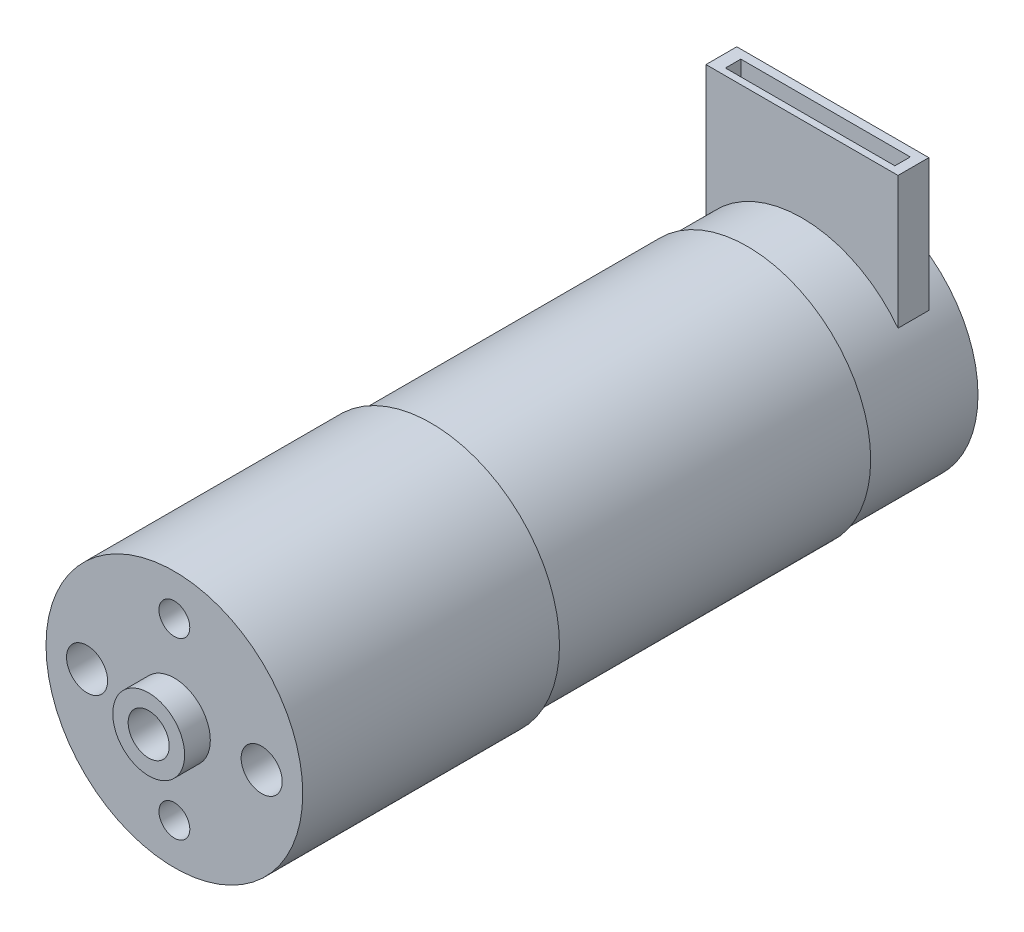
ISO-10303-21;
HEADER;
FILE_DESCRIPTION(('STEP AP214'),'2;1');
FILE_NAME('part.step','',(''),(''),'','','');
FILE_SCHEMA(('AUTOMOTIVE_DESIGN { 1 0 10303 214 1 1 1 1 }'));
ENDSEC;
DATA;
#1=APPLICATION_CONTEXT('core data for automotive mechanical design processes');
#2=APPLICATION_PROTOCOL_DEFINITION('international standard','automotive_design',2000,#1);
#3=PRODUCT_CONTEXT('',#1,'mechanical');
#4=PRODUCT('Part','Part','',(#3));
#5=PRODUCT_RELATED_PRODUCT_CATEGORY('part','',(#4));
#6=PRODUCT_DEFINITION_FORMATION('','',#4);
#7=PRODUCT_DEFINITION_CONTEXT('part definition',#1,'design');
#8=PRODUCT_DEFINITION('design','',#6,#7);
#9=PRODUCT_DEFINITION_SHAPE('','',#8);
#10=(LENGTH_UNIT() NAMED_UNIT(*) SI_UNIT(.MILLI.,.METRE.));
#11=(NAMED_UNIT(*) PLANE_ANGLE_UNIT() SI_UNIT($,.RADIAN.));
#12=(NAMED_UNIT(*) SI_UNIT($,.STERADIAN.) SOLID_ANGLE_UNIT());
#13=UNCERTAINTY_MEASURE_WITH_UNIT(LENGTH_MEASURE(1.E-05),#10,'distance_accuracy_value','');
#14=(GEOMETRIC_REPRESENTATION_CONTEXT(3) GLOBAL_UNCERTAINTY_ASSIGNED_CONTEXT((#13)) GLOBAL_UNIT_ASSIGNED_CONTEXT((#10,
#11,#12)) REPRESENTATION_CONTEXT('',''));
#15=CARTESIAN_POINT('',(0.,0.,0.));
#16=DIRECTION('',(0.,0.,1.));
#17=DIRECTION('',(1.,0.,0.));
#18=AXIS2_PLACEMENT_3D('',#15,#16,#17);
#19=CARTESIAN_POINT('',(0.,0.,-10.7));
#20=DIRECTION('',(0.,0.,1.));
#21=DIRECTION('',(1.,0.,0.));
#22=AXIS2_PLACEMENT_3D('',#19,#20,#21);
#23=CYLINDRICAL_SURFACE('',#22,11.75);
#24=CARTESIAN_POINT('',(0.,0.,0.));
#25=DIRECTION('',(0.,0.,1.));
#26=DIRECTION('',(1.,0.,0.));
#27=AXIS2_PLACEMENT_3D('',#24,#25,#26);
#28=CIRCLE('',#27,11.75);
#29=CARTESIAN_POINT('',(11.75,0.,0.));
#30=VERTEX_POINT('',#29);
#31=EDGE_CURVE('E181',#30,#30,#28,.F.);
#32=ORIENTED_EDGE('',*,*,#31,.T.);
#33=EDGE_LOOP('',(#32));
#34=FACE_BOUND('',#33,.T.);
#35=CARTESIAN_POINT('',(0.,0.,-10.7));
#36=DIRECTION('',(0.,0.,-1.));
#37=DIRECTION('',(-1.,0.,0.));
#38=AXIS2_PLACEMENT_3D('',#35,#36,#37);
#39=CIRCLE('',#38,11.75);
#40=CARTESIAN_POINT('',(-11.75,0.,-10.7));
#41=VERTEX_POINT('',#40);
#42=EDGE_CURVE('E162',#41,#41,#39,.T.);
#43=ORIENTED_EDGE('',*,*,#42,.F.);
#44=EDGE_LOOP('',(#43));
#45=FACE_BOUND('',#44,.T.);
#46=DIRECTION('',(0.,0.,1.));
#47=VECTOR('',#46,1.);
#48=CARTESIAN_POINT('',(-9.34971648878689,7.11655124195045,-10.7));
#49=LINE('',#48,#47);
#50=CARTESIAN_POINT('',(-9.34971648878689,7.11655124195045,-8.31237413965429));
#51=VERTEX_POINT('',#50);
#52=CARTESIAN_POINT('',(-9.34971648878689,7.11655124195045,-5.31237413965429));
#53=VERTEX_POINT('',#52);
#54=EDGE_CURVE('E11',#51,#53,#49,.T.);
#55=ORIENTED_EDGE('',*,*,#54,.F.);
#56=CARTESIAN_POINT('',(0.,0.,-8.31237413965429));
#57=DIRECTION('',(0.,0.,1.));
#58=DIRECTION('',(1.,0.,0.));
#59=AXIS2_PLACEMENT_3D('',#56,#57,#58);
#60=CIRCLE('',#59,11.75);
#61=CARTESIAN_POINT('',(9.34971648878689,7.11655124195045,-8.31237413965429));
#62=VERTEX_POINT('',#61);
#63=EDGE_CURVE('E186',#62,#51,#60,.T.);
#64=ORIENTED_EDGE('',*,*,#63,.F.);
#65=DIRECTION('',(0.,0.,1.));
#66=VECTOR('',#65,1.);
#67=CARTESIAN_POINT('',(9.34971648878689,7.11655124195045,-10.7));
#68=LINE('',#67,#66);
#69=CARTESIAN_POINT('',(9.34971648878689,7.11655124195045,-5.31237413965429));
#70=VERTEX_POINT('',#69);
#71=EDGE_CURVE('E189',#70,#62,#68,.F.);
#72=ORIENTED_EDGE('',*,*,#71,.F.);
#73=CARTESIAN_POINT('',(0.,0.,-5.31237413965429));
#74=DIRECTION('',(0.,0.,-1.));
#75=DIRECTION('',(-1.,0.,0.));
#76=AXIS2_PLACEMENT_3D('',#73,#74,#75);
#77=CIRCLE('',#76,11.75);
#78=EDGE_CURVE('E44',#53,#70,#77,.T.);
#79=ORIENTED_EDGE('',*,*,#78,.F.);
#80=EDGE_LOOP('',(#55,#64,#72,#79));
#81=FACE_BOUND('',#80,.T.);
#82=ADVANCED_FACE('F36',(#34,#45,#81),#23,.T.);
#83=CARTESIAN_POINT('',(0.,0.,30.8));
#84=DIRECTION('',(0.,0.,-1.));
#85=DIRECTION('',(-1.,0.,0.));
#86=AXIS2_PLACEMENT_3D('',#83,#84,#85);
#87=CYLINDRICAL_SURFACE('',#86,12.);
#88=CARTESIAN_POINT('',(0.,0.,30.8));
#89=DIRECTION('',(0.,0.,1.));
#90=DIRECTION('',(1.,0.,0.));
#91=AXIS2_PLACEMENT_3D('',#88,#89,#90);
#92=CIRCLE('',#91,12.);
#93=CARTESIAN_POINT('',(12.,0.,30.8));
#94=VERTEX_POINT('',#93);
#95=EDGE_CURVE('E178',#94,#94,#92,.T.);
#96=ORIENTED_EDGE('',*,*,#95,.F.);
#97=EDGE_LOOP('',(#96));
#98=FACE_BOUND('',#97,.T.);
#99=CARTESIAN_POINT('',(0.,0.,0.));
#100=DIRECTION('',(0.,0.,1.));
#101=DIRECTION('',(1.,0.,0.));
#102=AXIS2_PLACEMENT_3D('',#99,#100,#101);
#103=CIRCLE('',#102,12.);
#104=CARTESIAN_POINT('',(12.,0.,0.));
#105=VERTEX_POINT('',#104);
#106=EDGE_CURVE('E175',#105,#105,#103,.T.);
#107=ORIENTED_EDGE('',*,*,#106,.T.);
#108=EDGE_LOOP('',(#107));
#109=FACE_BOUND('',#108,.T.);
#110=ADVANCED_FACE('F38',(#98,#109),#87,.T.);
#111=CARTESIAN_POINT('',(0.,0.,0.));
#112=DIRECTION('',(0.,0.,1.));
#113=DIRECTION('',(1.,0.,0.));
#114=AXIS2_PLACEMENT_3D('',#111,#112,#113);
#115=PLANE('',#114);
#116=ORIENTED_EDGE('',*,*,#31,.F.);
#117=EDGE_LOOP('',(#116));
#118=FACE_BOUND('',#117,.T.);
#119=ORIENTED_EDGE('',*,*,#106,.F.);
#120=EDGE_LOOP('',(#119));
#121=FACE_BOUND('',#120,.T.);
#122=ADVANCED_FACE('F224',(#118,#121),#115,.F.);
#123=CARTESIAN_POINT('',(0.,0.,55.8));
#124=DIRECTION('',(0.,0.,-1.));
#125=DIRECTION('',(-1.,0.,0.));
#126=AXIS2_PLACEMENT_3D('',#123,#124,#125);
#127=CYLINDRICAL_SURFACE('',#126,12.5);
#128=CARTESIAN_POINT('',(0.,0.,55.8));
#129=DIRECTION('',(0.,0.,1.));
#130=DIRECTION('',(1.,0.,0.));
#131=AXIS2_PLACEMENT_3D('',#128,#129,#130);
#132=CIRCLE('',#131,12.5);
#133=CARTESIAN_POINT('',(12.5,0.,55.8));
#134=VERTEX_POINT('',#133);
#135=EDGE_CURVE('E172',#134,#134,#132,.T.);
#136=ORIENTED_EDGE('',*,*,#135,.F.);
#137=EDGE_LOOP('',(#136));
#138=FACE_BOUND('',#137,.T.);
#139=CARTESIAN_POINT('',(0.,0.,30.8));
#140=DIRECTION('',(0.,0.,1.));
#141=DIRECTION('',(1.,0.,0.));
#142=AXIS2_PLACEMENT_3D('',#139,#140,#141);
#143=CIRCLE('',#142,12.5);
#144=CARTESIAN_POINT('',(12.5,0.,30.8));
#145=VERTEX_POINT('',#144);
#146=EDGE_CURVE('E169',#145,#145,#143,.T.);
#147=ORIENTED_EDGE('',*,*,#146,.T.);
#148=EDGE_LOOP('',(#147));
#149=FACE_BOUND('',#148,.T.);
#150=ADVANCED_FACE('F243',(#138,#149),#127,.T.);
#151=CARTESIAN_POINT('',(0.,0.,55.8));
#152=DIRECTION('',(0.,0.,1.));
#153=DIRECTION('',(1.,0.,0.));
#154=AXIS2_PLACEMENT_3D('',#151,#152,#153);
#155=PLANE('',#154);
#156=CARTESIAN_POINT('',(0.,8.5,55.8));
#157=DIRECTION('',(0.,0.,1.));
#158=DIRECTION('',(1.,0.,0.));
#159=AXIS2_PLACEMENT_3D('',#156,#157,#158);
#160=CIRCLE('',#159,1.5);
#161=CARTESIAN_POINT('',(1.5,8.5,55.8));
#162=VERTEX_POINT('',#161);
#163=EDGE_CURVE('E461',#162,#162,#160,.T.);
#164=ORIENTED_EDGE('',*,*,#163,.F.);
#165=EDGE_LOOP('',(#164));
#166=FACE_BOUND('',#165,.T.);
#167=CARTESIAN_POINT('',(8.5,0.,55.8));
#168=DIRECTION('',(0.,0.,1.));
#169=DIRECTION('',(1.,0.,0.));
#170=AXIS2_PLACEMENT_3D('',#167,#168,#169);
#171=CIRCLE('',#170,2.);
#172=CARTESIAN_POINT('',(10.5,0.,55.8));
#173=VERTEX_POINT('',#172);
#174=EDGE_CURVE('E470',#173,#173,#171,.T.);
#175=ORIENTED_EDGE('',*,*,#174,.F.);
#176=EDGE_LOOP('',(#175));
#177=FACE_BOUND('',#176,.T.);
#178=CARTESIAN_POINT('',(-8.5,0.,55.8));
#179=DIRECTION('',(0.,0.,1.));
#180=DIRECTION('',(-1.,0.,0.));
#181=AXIS2_PLACEMENT_3D('',#178,#179,#180);
#182=CIRCLE('',#181,2.);
#183=CARTESIAN_POINT('',(-10.5,0.,55.8));
#184=VERTEX_POINT('',#183);
#185=EDGE_CURVE('E476',#184,#184,#182,.T.);
#186=ORIENTED_EDGE('',*,*,#185,.F.);
#187=EDGE_LOOP('',(#186));
#188=FACE_BOUND('',#187,.T.);
#189=CARTESIAN_POINT('',(0.,-8.5,55.8));
#190=DIRECTION('',(0.,0.,1.));
#191=DIRECTION('',(-1.,0.,0.));
#192=AXIS2_PLACEMENT_3D('',#189,#190,#191);
#193=CIRCLE('',#192,1.5);
#194=CARTESIAN_POINT('',(-1.5,-8.5,55.8));
#195=VERTEX_POINT('',#194);
#196=EDGE_CURVE('E482',#195,#195,#193,.T.);
#197=ORIENTED_EDGE('',*,*,#196,.F.);
#198=EDGE_LOOP('',(#197));
#199=FACE_BOUND('',#198,.T.);
#200=CARTESIAN_POINT('',(0.,0.,55.8));
#201=DIRECTION('',(0.,0.,1.));
#202=DIRECTION('',(1.,0.,0.));
#203=AXIS2_PLACEMENT_3D('',#200,#201,#202);
#204=CIRCLE('',#203,3.5);
#205=CARTESIAN_POINT('',(3.5,0.,55.8));
#206=VERTEX_POINT('',#205);
#207=EDGE_CURVE('E165',#206,#206,#204,.T.);
#208=ORIENTED_EDGE('',*,*,#207,.F.);
#209=EDGE_LOOP('',(#208));
#210=FACE_BOUND('',#209,.T.);
#211=ORIENTED_EDGE('',*,*,#135,.T.);
#212=EDGE_LOOP('',(#211));
#213=FACE_BOUND('',#212,.T.);
#214=ADVANCED_FACE('F240',(#166,#177,#188,#199,#210,#213),#155,.T.);
#215=CARTESIAN_POINT('',(0.,0.,30.8));
#216=DIRECTION('',(0.,0.,1.));
#217=DIRECTION('',(1.,0.,0.));
#218=AXIS2_PLACEMENT_3D('',#215,#216,#217);
#219=PLANE('',#218);
#220=ORIENTED_EDGE('',*,*,#95,.T.);
#221=EDGE_LOOP('',(#220));
#222=FACE_BOUND('',#221,.T.);
#223=ORIENTED_EDGE('',*,*,#146,.F.);
#224=EDGE_LOOP('',(#223));
#225=FACE_BOUND('',#224,.T.);
#226=ADVANCED_FACE('F238',(#222,#225),#219,.F.);
#227=CARTESIAN_POINT('',(0.,0.,58.3));
#228=DIRECTION('',(0.,0.,-1.));
#229=DIRECTION('',(-1.,0.,0.));
#230=AXIS2_PLACEMENT_3D('',#227,#228,#229);
#231=CYLINDRICAL_SURFACE('',#230,3.5);
#232=CARTESIAN_POINT('',(0.,0.,58.3));
#233=DIRECTION('',(0.,0.,1.));
#234=DIRECTION('',(1.,0.,0.));
#235=AXIS2_PLACEMENT_3D('',#232,#233,#234);
#236=CIRCLE('',#235,3.5);
#237=CARTESIAN_POINT('',(3.5,0.,58.3));
#238=VERTEX_POINT('',#237);
#239=EDGE_CURVE('E166',#238,#238,#236,.T.);
#240=ORIENTED_EDGE('',*,*,#239,.F.);
#241=EDGE_LOOP('',(#240));
#242=FACE_BOUND('',#241,.T.);
#243=ORIENTED_EDGE('',*,*,#207,.T.);
#244=EDGE_LOOP('',(#243));
#245=FACE_BOUND('',#244,.T.);
#246=ADVANCED_FACE('F234',(#242,#245),#231,.T.);
#247=CARTESIAN_POINT('',(0.,0.,58.3));
#248=DIRECTION('',(0.,0.,1.));
#249=DIRECTION('',(1.,0.,0.));
#250=AXIS2_PLACEMENT_3D('',#247,#248,#249);
#251=PLANE('',#250);
#252=CARTESIAN_POINT('',(0.,0.,58.3));
#253=DIRECTION('',(0.,0.,1.));
#254=DIRECTION('',(1.,0.,0.));
#255=AXIS2_PLACEMENT_3D('',#252,#253,#254);
#256=CIRCLE('',#255,2.);
#257=CARTESIAN_POINT('',(2.,0.,58.3));
#258=VERTEX_POINT('',#257);
#259=EDGE_CURVE('E125',#258,#258,#256,.T.);
#260=ORIENTED_EDGE('',*,*,#259,.F.);
#261=EDGE_LOOP('',(#260));
#262=FACE_BOUND('',#261,.T.);
#263=ORIENTED_EDGE('',*,*,#239,.T.);
#264=EDGE_LOOP('',(#263));
#265=FACE_BOUND('',#264,.T.);
#266=ADVANCED_FACE('F231',(#262,#265),#251,.T.);
#267=CARTESIAN_POINT('',(0.,0.,-10.7));
#268=DIRECTION('',(0.,0.,-1.));
#269=DIRECTION('',(-1.,0.,0.));
#270=AXIS2_PLACEMENT_3D('',#267,#268,#269);
#271=PLANE('',#270);
#272=ORIENTED_EDGE('',*,*,#42,.T.);
#273=EDGE_LOOP('',(#272));
#274=FACE_BOUND('',#273,.T.);
#275=ADVANCED_FACE('F229',(#274),#271,.T.);
#276=CARTESIAN_POINT('',(-9.34971648878689,20.,-8.31237413965429));
#277=DIRECTION('',(1.,0.,0.));
#278=DIRECTION('',(0.,0.,-1.));
#279=AXIS2_PLACEMENT_3D('',#276,#277,#278);
#280=PLANE('',#279);
#281=DIRECTION('',(0.,-1.,0.));
#282=VECTOR('',#281,1.);
#283=CARTESIAN_POINT('',(-9.34971648878689,20.,-8.31237413965429));
#284=LINE('',#283,#282);
#285=CARTESIAN_POINT('',(-9.34971648878689,20.,-8.31237413965429));
#286=VERTEX_POINT('',#285);
#287=EDGE_CURVE('E150',#286,#51,#284,.T.);
#288=ORIENTED_EDGE('',*,*,#287,.T.);
#289=ORIENTED_EDGE('',*,*,#54,.T.);
#290=DIRECTION('',(0.,-1.,0.));
#291=VECTOR('',#290,1.);
#292=CARTESIAN_POINT('',(-9.34971648878689,20.,-5.31237413965429));
#293=LINE('',#292,#291);
#294=CARTESIAN_POINT('',(-9.34971648878689,20.,-5.31237413965429));
#295=VERTEX_POINT('',#294);
#296=EDGE_CURVE('E159',#295,#53,#293,.T.);
#297=ORIENTED_EDGE('',*,*,#296,.F.);
#298=DIRECTION('',(0.,0.,1.));
#299=VECTOR('',#298,1.);
#300=CARTESIAN_POINT('',(-9.34971648878689,20.,-8.31237413965429));
#301=LINE('',#300,#299);
#302=EDGE_CURVE('E138',#286,#295,#301,.T.);
#303=ORIENTED_EDGE('',*,*,#302,.F.);
#304=EDGE_LOOP('',(#288,#289,#297,#303));
#305=FACE_BOUND('',#304,.T.);
#306=ADVANCED_FACE('F205',(#305),#280,.F.);
#307=CARTESIAN_POINT('',(9.34971648878689,20.,-8.31237413965429));
#308=DIRECTION('',(-1.,0.,0.));
#309=DIRECTION('',(0.,0.,1.));
#310=AXIS2_PLACEMENT_3D('',#307,#308,#309);
#311=PLANE('',#310);
#312=DIRECTION('',(0.,-1.,0.));
#313=VECTOR('',#312,1.);
#314=CARTESIAN_POINT('',(9.34971648878689,20.,-5.31237413965429));
#315=LINE('',#314,#313);
#316=CARTESIAN_POINT('',(9.34971648878689,20.,-5.31237413965429));
#317=VERTEX_POINT('',#316);
#318=EDGE_CURVE('E156',#317,#70,#315,.T.);
#319=ORIENTED_EDGE('',*,*,#318,.T.);
#320=ORIENTED_EDGE('',*,*,#71,.T.);
#321=DIRECTION('',(0.,-1.,0.));
#322=VECTOR('',#321,1.);
#323=CARTESIAN_POINT('',(9.34971648878689,20.,-8.31237413965429));
#324=LINE('',#323,#322);
#325=CARTESIAN_POINT('',(9.34971648878689,20.,-8.31237413965429));
#326=VERTEX_POINT('',#325);
#327=EDGE_CURVE('E153',#326,#62,#324,.T.);
#328=ORIENTED_EDGE('',*,*,#327,.F.);
#329=DIRECTION('',(0.,0.,-1.));
#330=VECTOR('',#329,1.);
#331=CARTESIAN_POINT('',(9.34971648878689,20.,-8.31237413965429));
#332=LINE('',#331,#330);
#333=EDGE_CURVE('E146',#317,#326,#332,.T.);
#334=ORIENTED_EDGE('',*,*,#333,.F.);
#335=EDGE_LOOP('',(#319,#320,#328,#334));
#336=FACE_BOUND('',#335,.T.);
#337=ADVANCED_FACE('F197',(#336),#311,.F.);
#338=CARTESIAN_POINT('',(9.34971648878689,20.,-5.31237413965429));
#339=DIRECTION('',(0.,0.,-1.));
#340=DIRECTION('',(-1.,0.,0.));
#341=AXIS2_PLACEMENT_3D('',#338,#339,#340);
#342=PLANE('',#341);
#343=ORIENTED_EDGE('',*,*,#296,.T.);
#344=ORIENTED_EDGE('',*,*,#78,.T.);
#345=ORIENTED_EDGE('',*,*,#318,.F.);
#346=DIRECTION('',(1.,0.,0.));
#347=VECTOR('',#346,1.);
#348=CARTESIAN_POINT('',(9.34971648878689,20.,-5.31237413965429));
#349=LINE('',#348,#347);
#350=EDGE_CURVE('E144',#295,#317,#349,.T.);
#351=ORIENTED_EDGE('',*,*,#350,.F.);
#352=EDGE_LOOP('',(#343,#344,#345,#351));
#353=FACE_BOUND('',#352,.T.);
#354=ADVANCED_FACE('F193',(#353),#342,.F.);
#355=CARTESIAN_POINT('',(9.34971648878689,20.,-8.31237413965429));
#356=DIRECTION('',(0.,0.,1.));
#357=DIRECTION('',(1.,0.,0.));
#358=AXIS2_PLACEMENT_3D('',#355,#356,#357);
#359=PLANE('',#358);
#360=ORIENTED_EDGE('',*,*,#327,.T.);
#361=ORIENTED_EDGE('',*,*,#63,.T.);
#362=ORIENTED_EDGE('',*,*,#287,.F.);
#363=DIRECTION('',(-1.,0.,0.));
#364=VECTOR('',#363,1.);
#365=CARTESIAN_POINT('',(9.34971648878689,20.,-8.31237413965429));
#366=LINE('',#365,#364);
#367=EDGE_CURVE('E148',#326,#286,#366,.T.);
#368=ORIENTED_EDGE('',*,*,#367,.F.);
#369=EDGE_LOOP('',(#360,#361,#362,#368));
#370=FACE_BOUND('',#369,.T.);
#371=ADVANCED_FACE('F207',(#370),#359,.F.);
#372=CARTESIAN_POINT('',(0.,20.,0.));
#373=DIRECTION('',(0.,-1.,0.));
#374=DIRECTION('',(0.,0.,-1.));
#375=AXIS2_PLACEMENT_3D('',#372,#373,#374);
#376=PLANE('',#375);
#377=DIRECTION('',(1.,0.,0.));
#378=VECTOR('',#377,1.);
#379=CARTESIAN_POINT('',(8.38729640794611,20.,-5.96838946504422));
#380=LINE('',#379,#378);
#381=CARTESIAN_POINT('',(-8.11270359205389,20.,-5.96838946504422));
#382=VERTEX_POINT('',#381);
#383=CARTESIAN_POINT('',(8.38729640794611,20.,-5.96838946504422));
#384=VERTEX_POINT('',#383);
#385=EDGE_CURVE('E131',#382,#384,#380,.T.);
#386=ORIENTED_EDGE('',*,*,#385,.F.);
#387=DIRECTION('',(0.,0.,1.));
#388=VECTOR('',#387,1.);
#389=CARTESIAN_POINT('',(-8.11270359205389,20.,-7.46838946504422));
#390=LINE('',#389,#388);
#391=CARTESIAN_POINT('',(-8.11270359205389,20.,-7.46838946504422));
#392=VERTEX_POINT('',#391);
#393=EDGE_CURVE('E51',#392,#382,#390,.T.);
#394=ORIENTED_EDGE('',*,*,#393,.F.);
#395=DIRECTION('',(-1.,0.,0.));
#396=VECTOR('',#395,1.);
#397=CARTESIAN_POINT('',(8.38729640794611,20.,-7.46838946504422));
#398=LINE('',#397,#396);
#399=CARTESIAN_POINT('',(8.38729640794611,20.,-7.46838946504422));
#400=VERTEX_POINT('',#399);
#401=EDGE_CURVE('E119',#400,#392,#398,.T.);
#402=ORIENTED_EDGE('',*,*,#401,.F.);
#403=DIRECTION('',(0.,0.,-1.));
#404=VECTOR('',#403,1.);
#405=CARTESIAN_POINT('',(8.38729640794611,20.,-7.46838946504422));
#406=LINE('',#405,#404);
#407=EDGE_CURVE('E122',#384,#400,#406,.T.);
#408=ORIENTED_EDGE('',*,*,#407,.F.);
#409=EDGE_LOOP('',(#386,#394,#402,#408));
#410=FACE_BOUND('',#409,.T.);
#411=ORIENTED_EDGE('',*,*,#302,.T.);
#412=ORIENTED_EDGE('',*,*,#350,.T.);
#413=ORIENTED_EDGE('',*,*,#333,.T.);
#414=ORIENTED_EDGE('',*,*,#367,.T.);
#415=EDGE_LOOP('',(#411,#412,#413,#414));
#416=FACE_BOUND('',#415,.T.);
#417=ADVANCED_FACE('F201',(#410,#416),#376,.F.);
#418=CARTESIAN_POINT('',(-8.11270359205389,10.,-7.46838946504422));
#419=DIRECTION('',(-1.,0.,0.));
#420=DIRECTION('',(0.,0.,1.));
#421=AXIS2_PLACEMENT_3D('',#418,#419,#420);
#422=PLANE('',#421);
#423=ORIENTED_EDGE('',*,*,#393,.T.);
#424=DIRECTION('',(0.,1.,0.));
#425=VECTOR('',#424,1.);
#426=CARTESIAN_POINT('',(-8.11270359205389,10.,-5.96838946504422));
#427=LINE('',#426,#425);
#428=CARTESIAN_POINT('',(-8.11270359205389,10.,-5.96838946504422));
#429=VERTEX_POINT('',#428);
#430=EDGE_CURVE('E97',#429,#382,#427,.T.);
#431=ORIENTED_EDGE('',*,*,#430,.F.);
#432=DIRECTION('',(0.,0.,1.));
#433=VECTOR('',#432,1.);
#434=CARTESIAN_POINT('',(-8.11270359205389,10.,-7.46838946504422));
#435=LINE('',#434,#433);
#436=CARTESIAN_POINT('',(-8.11270359205389,10.,-7.46838946504422));
#437=VERTEX_POINT('',#436);
#438=EDGE_CURVE('E101',#437,#429,#435,.T.);
#439=ORIENTED_EDGE('',*,*,#438,.F.);
#440=DIRECTION('',(0.,1.,0.));
#441=VECTOR('',#440,1.);
#442=CARTESIAN_POINT('',(-8.11270359205389,10.,-7.46838946504422));
#443=LINE('',#442,#441);
#444=EDGE_CURVE('E136',#437,#392,#443,.T.);
#445=ORIENTED_EDGE('',*,*,#444,.T.);
#446=EDGE_LOOP('',(#423,#431,#439,#445));
#447=FACE_BOUND('',#446,.T.);
#448=ADVANCED_FACE('F99',(#447),#422,.F.);
#449=CARTESIAN_POINT('',(8.38729640794611,10.,-7.46838946504422));
#450=DIRECTION('',(0.,0.,-1.));
#451=DIRECTION('',(-1.,0.,0.));
#452=AXIS2_PLACEMENT_3D('',#449,#450,#451);
#453=PLANE('',#452);
#454=ORIENTED_EDGE('',*,*,#401,.T.);
#455=ORIENTED_EDGE('',*,*,#444,.F.);
#456=DIRECTION('',(-1.,0.,0.));
#457=VECTOR('',#456,1.);
#458=CARTESIAN_POINT('',(8.38729640794611,10.,-7.46838946504422));
#459=LINE('',#458,#457);
#460=CARTESIAN_POINT('',(8.38729640794611,10.,-7.46838946504422));
#461=VERTEX_POINT('',#460);
#462=EDGE_CURVE('E107',#461,#437,#459,.T.);
#463=ORIENTED_EDGE('',*,*,#462,.F.);
#464=DIRECTION('',(0.,1.,0.));
#465=VECTOR('',#464,1.);
#466=CARTESIAN_POINT('',(8.38729640794611,10.,-7.46838946504422));
#467=LINE('',#466,#465);
#468=EDGE_CURVE('E139',#461,#400,#467,.T.);
#469=ORIENTED_EDGE('',*,*,#468,.T.);
#470=EDGE_LOOP('',(#454,#455,#463,#469));
#471=FACE_BOUND('',#470,.T.);
#472=ADVANCED_FACE('F323',(#471),#453,.F.);
#473=CARTESIAN_POINT('',(8.38729640794611,10.,-7.46838946504422));
#474=DIRECTION('',(1.,0.,0.));
#475=DIRECTION('',(0.,0.,-1.));
#476=AXIS2_PLACEMENT_3D('',#473,#474,#475);
#477=PLANE('',#476);
#478=ORIENTED_EDGE('',*,*,#407,.T.);
#479=ORIENTED_EDGE('',*,*,#468,.F.);
#480=DIRECTION('',(0.,0.,-1.));
#481=VECTOR('',#480,1.);
#482=CARTESIAN_POINT('',(8.38729640794611,10.,-7.46838946504422));
#483=LINE('',#482,#481);
#484=CARTESIAN_POINT('',(8.38729640794611,10.,-5.96838946504422));
#485=VERTEX_POINT('',#484);
#486=EDGE_CURVE('E115',#485,#461,#483,.T.);
#487=ORIENTED_EDGE('',*,*,#486,.F.);
#488=DIRECTION('',(0.,1.,0.));
#489=VECTOR('',#488,1.);
#490=CARTESIAN_POINT('',(8.38729640794611,10.,-5.96838946504422));
#491=LINE('',#490,#489);
#492=EDGE_CURVE('E106',#485,#384,#491,.T.);
#493=ORIENTED_EDGE('',*,*,#492,.T.);
#494=EDGE_LOOP('',(#478,#479,#487,#493));
#495=FACE_BOUND('',#494,.T.);
#496=ADVANCED_FACE('F332',(#495),#477,.F.);
#497=CARTESIAN_POINT('',(8.38729640794611,10.,-5.96838946504422));
#498=DIRECTION('',(0.,0.,1.));
#499=DIRECTION('',(1.,0.,0.));
#500=AXIS2_PLACEMENT_3D('',#497,#498,#499);
#501=PLANE('',#500);
#502=ORIENTED_EDGE('',*,*,#385,.T.);
#503=ORIENTED_EDGE('',*,*,#492,.F.);
#504=DIRECTION('',(1.,0.,0.));
#505=VECTOR('',#504,1.);
#506=CARTESIAN_POINT('',(8.38729640794611,10.,-5.96838946504422));
#507=LINE('',#506,#505);
#508=EDGE_CURVE('E110',#429,#485,#507,.T.);
#509=ORIENTED_EDGE('',*,*,#508,.F.);
#510=ORIENTED_EDGE('',*,*,#430,.T.);
#511=EDGE_LOOP('',(#502,#503,#509,#510));
#512=FACE_BOUND('',#511,.T.);
#513=ADVANCED_FACE('F111',(#512),#501,.F.);
#514=CARTESIAN_POINT('',(0.,10.,0.));
#515=DIRECTION('',(0.,-1.,0.));
#516=DIRECTION('',(0.,0.,-1.));
#517=AXIS2_PLACEMENT_3D('',#514,#515,#516);
#518=PLANE('',#517);
#519=ORIENTED_EDGE('',*,*,#438,.T.);
#520=ORIENTED_EDGE('',*,*,#508,.T.);
#521=ORIENTED_EDGE('',*,*,#486,.T.);
#522=ORIENTED_EDGE('',*,*,#462,.T.);
#523=EDGE_LOOP('',(#519,#520,#521,#522));
#524=FACE_BOUND('',#523,.T.);
#525=ADVANCED_FACE('F117',(#524),#518,.F.);
#526=CARTESIAN_POINT('',(0.,0.,48.3));
#527=DIRECTION('',(0.,0.,1.));
#528=DIRECTION('',(1.,0.,0.));
#529=AXIS2_PLACEMENT_3D('',#526,#527,#528);
#530=CYLINDRICAL_SURFACE('',#529,2.);
#531=CARTESIAN_POINT('',(0.,0.,48.3));
#532=DIRECTION('',(0.,0.,1.));
#533=DIRECTION('',(1.,0.,0.));
#534=AXIS2_PLACEMENT_3D('',#531,#532,#533);
#535=CIRCLE('',#534,2.);
#536=CARTESIAN_POINT('',(2.,0.,48.3));
#537=VERTEX_POINT('',#536);
#538=EDGE_CURVE('E132',#537,#537,#535,.T.);
#539=ORIENTED_EDGE('',*,*,#538,.F.);
#540=EDGE_LOOP('',(#539));
#541=FACE_BOUND('',#540,.T.);
#542=ORIENTED_EDGE('',*,*,#259,.T.);
#543=EDGE_LOOP('',(#542));
#544=FACE_BOUND('',#543,.T.);
#545=ADVANCED_FACE('F357',(#541,#544),#530,.F.);
#546=CARTESIAN_POINT('',(0.,0.,48.3));
#547=DIRECTION('',(0.,0.,1.));
#548=DIRECTION('',(1.,0.,0.));
#549=AXIS2_PLACEMENT_3D('',#546,#547,#548);
#550=PLANE('',#549);
#551=ORIENTED_EDGE('',*,*,#538,.T.);
#552=EDGE_LOOP('',(#551));
#553=FACE_BOUND('',#552,.T.);
#554=ADVANCED_FACE('F366',(#553),#550,.T.);
#555=CARTESIAN_POINT('',(0.,-8.5,45.8));
#556=DIRECTION('',(0.,0.,1.));
#557=DIRECTION('',(1.,0.,0.));
#558=AXIS2_PLACEMENT_3D('',#555,#556,#557);
#559=CYLINDRICAL_SURFACE('',#558,1.5);
#560=CARTESIAN_POINT('',(0.,-8.5,45.8));
#561=DIRECTION('',(0.,0.,1.));
#562=DIRECTION('',(-1.,0.,0.));
#563=AXIS2_PLACEMENT_3D('',#560,#561,#562);
#564=CIRCLE('',#563,1.5);
#565=CARTESIAN_POINT('',(-1.5,-8.5,45.8));
#566=VERTEX_POINT('',#565);
#567=EDGE_CURVE('E479',#566,#566,#564,.T.);
#568=ORIENTED_EDGE('',*,*,#567,.F.);
#569=EDGE_LOOP('',(#568));
#570=FACE_BOUND('',#569,.T.);
#571=ORIENTED_EDGE('',*,*,#196,.T.);
#572=EDGE_LOOP('',(#571));
#573=FACE_BOUND('',#572,.T.);
#574=ADVANCED_FACE('F372',(#570,#573),#559,.F.);
#575=CARTESIAN_POINT('',(0.,-8.5,45.8));
#576=DIRECTION('',(0.,0.,-1.));
#577=DIRECTION('',(-1.,0.,0.));
#578=AXIS2_PLACEMENT_3D('',#575,#576,#577);
#579=PLANE('',#578);
#580=ORIENTED_EDGE('',*,*,#567,.T.);
#581=EDGE_LOOP('',(#580));
#582=FACE_BOUND('',#581,.T.);
#583=ADVANCED_FACE('F379',(#582),#579,.F.);
#584=CARTESIAN_POINT('',(-8.5,0.,45.8));
#585=DIRECTION('',(0.,0.,1.));
#586=DIRECTION('',(1.,0.,0.));
#587=AXIS2_PLACEMENT_3D('',#584,#585,#586);
#588=CYLINDRICAL_SURFACE('',#587,2.);
#589=CARTESIAN_POINT('',(-8.5,0.,45.8));
#590=DIRECTION('',(0.,0.,1.));
#591=DIRECTION('',(-1.,0.,0.));
#592=AXIS2_PLACEMENT_3D('',#589,#590,#591);
#593=CIRCLE('',#592,2.);
#594=CARTESIAN_POINT('',(-10.5,0.,45.8));
#595=VERTEX_POINT('',#594);
#596=EDGE_CURVE('E473',#595,#595,#593,.T.);
#597=ORIENTED_EDGE('',*,*,#596,.F.);
#598=EDGE_LOOP('',(#597));
#599=FACE_BOUND('',#598,.T.);
#600=ORIENTED_EDGE('',*,*,#185,.T.);
#601=EDGE_LOOP('',(#600));
#602=FACE_BOUND('',#601,.T.);
#603=ADVANCED_FACE('F387',(#599,#602),#588,.F.);
#604=CARTESIAN_POINT('',(-8.5,0.,45.8));
#605=DIRECTION('',(0.,0.,-1.));
#606=DIRECTION('',(-1.,0.,0.));
#607=AXIS2_PLACEMENT_3D('',#604,#605,#606);
#608=PLANE('',#607);
#609=ORIENTED_EDGE('',*,*,#596,.T.);
#610=EDGE_LOOP('',(#609));
#611=FACE_BOUND('',#610,.T.);
#612=ADVANCED_FACE('F395',(#611),#608,.F.);
#613=CARTESIAN_POINT('',(8.5,0.,45.8));
#614=DIRECTION('',(0.,0.,1.));
#615=DIRECTION('',(1.,0.,0.));
#616=AXIS2_PLACEMENT_3D('',#613,#614,#615);
#617=CYLINDRICAL_SURFACE('',#616,2.);
#618=CARTESIAN_POINT('',(8.5,0.,45.8));
#619=DIRECTION('',(0.,0.,1.));
#620=DIRECTION('',(1.,0.,0.));
#621=AXIS2_PLACEMENT_3D('',#618,#619,#620);
#622=CIRCLE('',#621,2.);
#623=CARTESIAN_POINT('',(10.5,0.,45.8));
#624=VERTEX_POINT('',#623);
#625=EDGE_CURVE('E465',#624,#624,#622,.T.);
#626=ORIENTED_EDGE('',*,*,#625,.F.);
#627=EDGE_LOOP('',(#626));
#628=FACE_BOUND('',#627,.T.);
#629=ORIENTED_EDGE('',*,*,#174,.T.);
#630=EDGE_LOOP('',(#629));
#631=FACE_BOUND('',#630,.T.);
#632=ADVANCED_FACE('F403',(#628,#631),#617,.F.);
#633=CARTESIAN_POINT('',(8.5,0.,45.8));
#634=DIRECTION('',(0.,0.,1.));
#635=DIRECTION('',(1.,0.,0.));
#636=AXIS2_PLACEMENT_3D('',#633,#634,#635);
#637=PLANE('',#636);
#638=ORIENTED_EDGE('',*,*,#625,.T.);
#639=EDGE_LOOP('',(#638));
#640=FACE_BOUND('',#639,.T.);
#641=ADVANCED_FACE('F411',(#640),#637,.T.);
#642=CARTESIAN_POINT('',(0.,8.5,45.8));
#643=DIRECTION('',(0.,0.,1.));
#644=DIRECTION('',(1.,0.,0.));
#645=AXIS2_PLACEMENT_3D('',#642,#643,#644);
#646=CYLINDRICAL_SURFACE('',#645,1.5);
#647=CARTESIAN_POINT('',(0.,8.5,45.8));
#648=DIRECTION('',(0.,0.,1.));
#649=DIRECTION('',(1.,0.,0.));
#650=AXIS2_PLACEMENT_3D('',#647,#648,#649);
#651=CIRCLE('',#650,1.5);
#652=CARTESIAN_POINT('',(1.5,8.5,45.8));
#653=VERTEX_POINT('',#652);
#654=EDGE_CURVE('E460',#653,#653,#651,.T.);
#655=ORIENTED_EDGE('',*,*,#654,.F.);
#656=EDGE_LOOP('',(#655));
#657=FACE_BOUND('',#656,.T.);
#658=ORIENTED_EDGE('',*,*,#163,.T.);
#659=EDGE_LOOP('',(#658));
#660=FACE_BOUND('',#659,.T.);
#661=ADVANCED_FACE('F419',(#657,#660),#646,.F.);
#662=CARTESIAN_POINT('',(0.,8.5,45.8));
#663=DIRECTION('',(0.,0.,1.));
#664=DIRECTION('',(1.,0.,0.));
#665=AXIS2_PLACEMENT_3D('',#662,#663,#664);
#666=PLANE('',#665);
#667=ORIENTED_EDGE('',*,*,#654,.T.);
#668=EDGE_LOOP('',(#667));
#669=FACE_BOUND('',#668,.T.);
#670=ADVANCED_FACE('F427',(#669),#666,.T.);
#671=CLOSED_SHELL('',(#82,#110,#122,#150,#214,#226,#246,#266,#275,#306,#337,#354,#371,#417,#448,
#472,#496,#513,#525,#545,#554,#574,#583,#603,#612,#632,#641,#661,#670));
#672=MANIFOLD_SOLID_BREP('B2',#671);
#673=ADVANCED_BREP_SHAPE_REPRESENTATION('',(#18,#672),#14);
#674=SHAPE_DEFINITION_REPRESENTATION(#9,#673);
ENDSEC;
END-ISO-10303-21;
